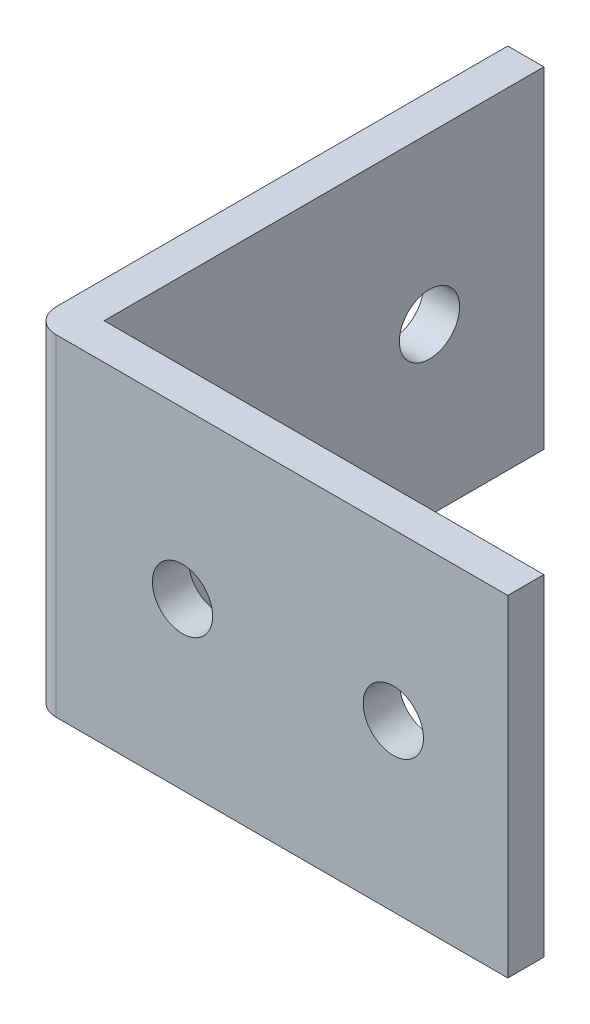
ISO-10303-21;
HEADER;
FILE_DESCRIPTION(('STEP AP214'),'2;1');
FILE_NAME('part.step','',(''),(''),'','','');
FILE_SCHEMA(('AUTOMOTIVE_DESIGN { 1 0 10303 214 1 1 1 1 }'));
ENDSEC;
DATA;
#1=APPLICATION_CONTEXT('core data for automotive mechanical design processes');
#2=APPLICATION_PROTOCOL_DEFINITION('international standard','automotive_design',2000,#1);
#3=PRODUCT_CONTEXT('',#1,'mechanical');
#4=PRODUCT('Part','Part','',(#3));
#5=PRODUCT_RELATED_PRODUCT_CATEGORY('part','',(#4));
#6=PRODUCT_DEFINITION_FORMATION('','',#4);
#7=PRODUCT_DEFINITION_CONTEXT('part definition',#1,'design');
#8=PRODUCT_DEFINITION('design','',#6,#7);
#9=PRODUCT_DEFINITION_SHAPE('','',#8);
#10=(LENGTH_UNIT() NAMED_UNIT(*) SI_UNIT(.MILLI.,.METRE.));
#11=(NAMED_UNIT(*) PLANE_ANGLE_UNIT() SI_UNIT($,.RADIAN.));
#12=(NAMED_UNIT(*) SI_UNIT($,.STERADIAN.) SOLID_ANGLE_UNIT());
#13=UNCERTAINTY_MEASURE_WITH_UNIT(LENGTH_MEASURE(1.E-05),#10,'distance_accuracy_value','');
#14=(GEOMETRIC_REPRESENTATION_CONTEXT(3) GLOBAL_UNCERTAINTY_ASSIGNED_CONTEXT((#13)) GLOBAL_UNIT_ASSIGNED_CONTEXT((#10,
#11,#12)) REPRESENTATION_CONTEXT('',''));
#15=CARTESIAN_POINT('',(0.,0.,0.));
#16=DIRECTION('',(0.,0.,1.));
#17=DIRECTION('',(1.,0.,0.));
#18=AXIS2_PLACEMENT_3D('',#15,#16,#17);
#19=CARTESIAN_POINT('',(0.,0.,0.));
#20=DIRECTION('',(0.,0.,1.));
#21=DIRECTION('',(1.,0.,0.));
#22=AXIS2_PLACEMENT_3D('',#19,#20,#21);
#23=PLANE('',#22);
#24=CARTESIAN_POINT('',(-7.13280898876404,-12.897191011236,0.));
#25=DIRECTION('',(0.,0.,1.));
#26=DIRECTION('',(1.,0.,0.));
#27=AXIS2_PLACEMENT_3D('',#24,#25,#26);
#28=CIRCLE('',#27,2.5);
#29=CARTESIAN_POINT('',(-4.63280898876404,-12.897191011236,0.));
#30=VERTEX_POINT('',#29);
#31=EDGE_CURVE('E127',#30,#30,#28,.T.);
#32=ORIENTED_EDGE('',*,*,#31,.T.);
#33=EDGE_LOOP('',(#32));
#34=FACE_BOUND('',#33,.T.);
#35=CARTESIAN_POINT('',(-24.632808988764,-12.897191011236,0.));
#36=DIRECTION('',(0.,0.,1.));
#37=DIRECTION('',(1.,0.,0.));
#38=AXIS2_PLACEMENT_3D('',#35,#36,#37);
#39=CIRCLE('',#38,2.5);
#40=CARTESIAN_POINT('',(-22.132808988764,-12.897191011236,0.));
#41=VERTEX_POINT('',#40);
#42=EDGE_CURVE('E131',#41,#41,#39,.T.);
#43=ORIENTED_EDGE('',*,*,#42,.T.);
#44=EDGE_LOOP('',(#43));
#45=FACE_BOUND('',#44,.T.);
#46=DIRECTION('',(0.,-1.,0.));
#47=VECTOR('',#46,1.);
#48=CARTESIAN_POINT('',(-34.132808988764,0.852808988764045,0.));
#49=LINE('',#48,#47);
#50=CARTESIAN_POINT('',(-34.132808988764,0.852808988764045,0.));
#51=VERTEX_POINT('',#50);
#52=CARTESIAN_POINT('',(-34.132808988764,-26.647191011236,0.));
#53=VERTEX_POINT('',#52);
#54=EDGE_CURVE('E113',#51,#53,#49,.T.);
#55=ORIENTED_EDGE('',*,*,#54,.F.);
#56=DIRECTION('',(-1.,0.,0.));
#57=VECTOR('',#56,1.);
#58=CARTESIAN_POINT('',(-37.132808988764,0.852808988764045,0.));
#59=LINE('',#58,#57);
#60=CARTESIAN_POINT('',(2.36719101123596,0.852808988764045,0.));
#61=VERTEX_POINT('',#60);
#62=EDGE_CURVE('E143',#61,#51,#59,.T.);
#63=ORIENTED_EDGE('',*,*,#62,.F.);
#64=DIRECTION('',(0.,1.,0.));
#65=VECTOR('',#64,1.);
#66=CARTESIAN_POINT('',(2.36719101123596,0.852808988764045,0.));
#67=LINE('',#66,#65);
#68=CARTESIAN_POINT('',(2.36719101123596,-26.647191011236,0.));
#69=VERTEX_POINT('',#68);
#70=EDGE_CURVE('E148',#69,#61,#67,.T.);
#71=ORIENTED_EDGE('',*,*,#70,.F.);
#72=DIRECTION('',(1.,0.,0.));
#73=VECTOR('',#72,1.);
#74=CARTESIAN_POINT('',(-37.132808988764,-26.647191011236,0.));
#75=LINE('',#74,#73);
#76=EDGE_CURVE('E137',#53,#69,#75,.T.);
#77=ORIENTED_EDGE('',*,*,#76,.F.);
#78=EDGE_LOOP('',(#55,#63,#71,#77));
#79=FACE_BOUND('',#78,.T.);
#80=ADVANCED_FACE('F34',(#34,#45,#79),#23,.F.);
#81=CARTESIAN_POINT('',(0.,0.,3.));
#82=DIRECTION('',(0.,0.,1.));
#83=DIRECTION('',(1.,0.,0.));
#84=AXIS2_PLACEMENT_3D('',#81,#82,#83);
#85=PLANE('',#84);
#86=CARTESIAN_POINT('',(-24.632808988764,-12.897191011236,3.));
#87=DIRECTION('',(0.,0.,1.));
#88=DIRECTION('',(1.,0.,0.));
#89=AXIS2_PLACEMENT_3D('',#86,#87,#88);
#90=CIRCLE('',#89,2.5);
#91=CARTESIAN_POINT('',(-22.132808988764,-12.897191011236,3.));
#92=VERTEX_POINT('',#91);
#93=EDGE_CURVE('E134',#92,#92,#90,.T.);
#94=ORIENTED_EDGE('',*,*,#93,.F.);
#95=EDGE_LOOP('',(#94));
#96=FACE_BOUND('',#95,.T.);
#97=DIRECTION('',(-1.,0.,0.));
#98=VECTOR('',#97,1.);
#99=CARTESIAN_POINT('',(-37.132808988764,0.852808988764045,3.));
#100=LINE('',#99,#98);
#101=CARTESIAN_POINT('',(2.36719101123596,0.852808988764045,3.));
#102=VERTEX_POINT('',#101);
#103=CARTESIAN_POINT('',(-35.132808988764,0.852808988764045,3.));
#104=VERTEX_POINT('',#103);
#105=EDGE_CURVE('E97',#102,#104,#100,.T.);
#106=ORIENTED_EDGE('',*,*,#105,.T.);
#107=DIRECTION('',(0.,-1.,0.));
#108=VECTOR('',#107,1.);
#109=CARTESIAN_POINT('',(-35.132808988764,-26.647191011236,3.));
#110=LINE('',#109,#108);
#111=CARTESIAN_POINT('',(-35.132808988764,-26.647191011236,3.));
#112=VERTEX_POINT('',#111);
#113=EDGE_CURVE('E158',#104,#112,#110,.T.);
#114=ORIENTED_EDGE('',*,*,#113,.T.);
#115=DIRECTION('',(1.,0.,0.));
#116=VECTOR('',#115,1.);
#117=CARTESIAN_POINT('',(-37.132808988764,-26.647191011236,3.));
#118=LINE('',#117,#116);
#119=CARTESIAN_POINT('',(2.36719101123596,-26.647191011236,3.));
#120=VERTEX_POINT('',#119);
#121=EDGE_CURVE('E140',#112,#120,#118,.T.);
#122=ORIENTED_EDGE('',*,*,#121,.T.);
#123=DIRECTION('',(0.,1.,0.));
#124=VECTOR('',#123,1.);
#125=CARTESIAN_POINT('',(2.36719101123596,0.852808988764045,3.));
#126=LINE('',#125,#124);
#127=EDGE_CURVE('E142',#120,#102,#126,.T.);
#128=ORIENTED_EDGE('',*,*,#127,.T.);
#129=EDGE_LOOP('',(#106,#114,#122,#128));
#130=FACE_BOUND('',#129,.T.);
#131=CARTESIAN_POINT('',(-7.13280898876404,-12.897191011236,3.));
#132=DIRECTION('',(0.,0.,1.));
#133=DIRECTION('',(1.,0.,0.));
#134=AXIS2_PLACEMENT_3D('',#131,#132,#133);
#135=CIRCLE('',#134,2.5);
#136=CARTESIAN_POINT('',(-4.63280898876404,-12.897191011236,3.));
#137=VERTEX_POINT('',#136);
#138=EDGE_CURVE('E128',#137,#137,#135,.T.);
#139=ORIENTED_EDGE('',*,*,#138,.F.);
#140=EDGE_LOOP('',(#139));
#141=FACE_BOUND('',#140,.T.);
#142=ADVANCED_FACE('F163',(#96,#130,#141),#85,.T.);
#143=CARTESIAN_POINT('',(-37.132808988764,0.852808988764045,3.));
#144=DIRECTION('',(1.,0.,0.));
#145=DIRECTION('',(0.,0.,-1.));
#146=AXIS2_PLACEMENT_3D('',#143,#144,#145);
#147=PLANE('',#146);
#148=CARTESIAN_POINT('',(-37.132808988764,-12.897191011236,-9.49999999999999));
#149=DIRECTION('',(1.,0.,0.));
#150=DIRECTION('',(0.,0.,-1.));
#151=AXIS2_PLACEMENT_3D('',#148,#149,#150);
#152=CIRCLE('',#151,2.5);
#153=CARTESIAN_POINT('',(-37.132808988764,-12.897191011236,-12.));
#154=VERTEX_POINT('',#153);
#155=EDGE_CURVE('E116',#154,#154,#152,.T.);
#156=ORIENTED_EDGE('',*,*,#155,.T.);
#157=EDGE_LOOP('',(#156));
#158=FACE_BOUND('',#157,.T.);
#159=CARTESIAN_POINT('',(-37.132808988764,-12.897191011236,-27.));
#160=DIRECTION('',(1.,0.,0.));
#161=DIRECTION('',(0.,0.,-1.));
#162=AXIS2_PLACEMENT_3D('',#159,#160,#161);
#163=CIRCLE('',#162,2.5);
#164=CARTESIAN_POINT('',(-37.132808988764,-12.897191011236,-29.5));
#165=VERTEX_POINT('',#164);
#166=EDGE_CURVE('E209',#165,#165,#163,.T.);
#167=ORIENTED_EDGE('',*,*,#166,.T.);
#168=EDGE_LOOP('',(#167));
#169=FACE_BOUND('',#168,.T.);
#170=DIRECTION('',(0.,0.,-1.));
#171=VECTOR('',#170,1.);
#172=CARTESIAN_POINT('',(-37.132808988764,-26.647191011236,3.));
#173=LINE('',#172,#171);
#174=CARTESIAN_POINT('',(-37.132808988764,-26.647191011236,1.));
#175=VERTEX_POINT('',#174);
#176=CARTESIAN_POINT('',(-37.132808988764,-26.647191011236,-36.5));
#177=VERTEX_POINT('',#176);
#178=EDGE_CURVE('E156',#175,#177,#173,.T.);
#179=ORIENTED_EDGE('',*,*,#178,.F.);
#180=DIRECTION('',(0.,-1.,0.));
#181=VECTOR('',#180,1.);
#182=CARTESIAN_POINT('',(-37.132808988764,0.852808988764045,1.));
#183=LINE('',#182,#181);
#184=CARTESIAN_POINT('',(-37.132808988764,0.852808988764045,1.));
#185=VERTEX_POINT('',#184);
#186=EDGE_CURVE('E42',#175,#185,#183,.F.);
#187=ORIENTED_EDGE('',*,*,#186,.T.);
#188=DIRECTION('',(0.,0.,-1.));
#189=VECTOR('',#188,1.);
#190=CARTESIAN_POINT('',(-37.132808988764,0.852808988764045,3.));
#191=LINE('',#190,#189);
#192=CARTESIAN_POINT('',(-37.132808988764,0.852808988764045,-36.5));
#193=VERTEX_POINT('',#192);
#194=EDGE_CURVE('E89',#185,#193,#191,.T.);
#195=ORIENTED_EDGE('',*,*,#194,.T.);
#196=DIRECTION('',(0.,1.,0.));
#197=VECTOR('',#196,1.);
#198=CARTESIAN_POINT('',(-37.132808988764,0.852808988764045,-36.5));
#199=LINE('',#198,#197);
#200=EDGE_CURVE('E93',#177,#193,#199,.T.);
#201=ORIENTED_EDGE('',*,*,#200,.F.);
#202=EDGE_LOOP('',(#179,#187,#195,#201));
#203=FACE_BOUND('',#202,.T.);
#204=ADVANCED_FACE('F91',(#158,#169,#203),#147,.F.);
#205=CARTESIAN_POINT('',(-37.132808988764,-26.647191011236,3.));
#206=DIRECTION('',(0.,1.,0.));
#207=DIRECTION('',(0.,0.,1.));
#208=AXIS2_PLACEMENT_3D('',#205,#206,#207);
#209=PLANE('',#208);
#210=ORIENTED_EDGE('',*,*,#121,.F.);
#211=CARTESIAN_POINT('',(-35.132808988764,-26.647191011236,1.));
#212=DIRECTION('',(0.,1.,0.));
#213=DIRECTION('',(0.,0.,1.));
#214=AXIS2_PLACEMENT_3D('',#211,#212,#213);
#215=CIRCLE('',#214,2.);
#216=EDGE_CURVE('E56',#112,#175,#215,.F.);
#217=ORIENTED_EDGE('',*,*,#216,.T.);
#218=ORIENTED_EDGE('',*,*,#178,.T.);
#219=DIRECTION('',(-1.,0.,0.));
#220=VECTOR('',#219,1.);
#221=CARTESIAN_POINT('',(-37.132808988764,-26.647191011236,-36.5));
#222=LINE('',#221,#220);
#223=CARTESIAN_POINT('',(-34.132808988764,-26.647191011236,-36.5));
#224=VERTEX_POINT('',#223);
#225=EDGE_CURVE('E112',#224,#177,#222,.T.);
#226=ORIENTED_EDGE('',*,*,#225,.F.);
#227=DIRECTION('',(0.,0.,1.));
#228=VECTOR('',#227,1.);
#229=CARTESIAN_POINT('',(-34.132808988764,-26.647191011236,-36.5));
#230=LINE('',#229,#228);
#231=EDGE_CURVE('E122',#224,#53,#230,.T.);
#232=ORIENTED_EDGE('',*,*,#231,.T.);
#233=ORIENTED_EDGE('',*,*,#76,.T.);
#234=DIRECTION('',(0.,0.,-1.));
#235=VECTOR('',#234,1.);
#236=CARTESIAN_POINT('',(2.36719101123596,-26.647191011236,3.));
#237=LINE('',#236,#235);
#238=EDGE_CURVE('E153',#120,#69,#237,.T.);
#239=ORIENTED_EDGE('',*,*,#238,.F.);
#240=EDGE_LOOP('',(#210,#217,#218,#226,#232,#233,#239));
#241=FACE_BOUND('',#240,.T.);
#242=ADVANCED_FACE('F168',(#241),#209,.F.);
#243=CARTESIAN_POINT('',(2.36719101123596,0.852808988764045,3.));
#244=DIRECTION('',(-1.,0.,0.));
#245=DIRECTION('',(0.,-1.,0.));
#246=AXIS2_PLACEMENT_3D('',#243,#244,#245);
#247=PLANE('',#246);
#248=ORIENTED_EDGE('',*,*,#70,.T.);
#249=DIRECTION('',(0.,0.,-1.));
#250=VECTOR('',#249,1.);
#251=CARTESIAN_POINT('',(2.36719101123596,0.852808988764045,3.));
#252=LINE('',#251,#250);
#253=EDGE_CURVE('E96',#102,#61,#252,.T.);
#254=ORIENTED_EDGE('',*,*,#253,.F.);
#255=ORIENTED_EDGE('',*,*,#127,.F.);
#256=ORIENTED_EDGE('',*,*,#238,.T.);
#257=EDGE_LOOP('',(#248,#254,#255,#256));
#258=FACE_BOUND('',#257,.T.);
#259=ADVANCED_FACE('F173',(#258),#247,.F.);
#260=CARTESIAN_POINT('',(-37.132808988764,0.852808988764045,3.));
#261=DIRECTION('',(0.,-1.,0.));
#262=DIRECTION('',(0.,0.,-1.));
#263=AXIS2_PLACEMENT_3D('',#260,#261,#262);
#264=PLANE('',#263);
#265=ORIENTED_EDGE('',*,*,#194,.F.);
#266=CARTESIAN_POINT('',(-35.132808988764,0.852808988764045,1.));
#267=DIRECTION('',(0.,-1.,0.));
#268=DIRECTION('',(0.,0.,-1.));
#269=AXIS2_PLACEMENT_3D('',#266,#267,#268);
#270=CIRCLE('',#269,2.);
#271=EDGE_CURVE('E11',#185,#104,#270,.F.);
#272=ORIENTED_EDGE('',*,*,#271,.T.);
#273=ORIENTED_EDGE('',*,*,#105,.F.);
#274=ORIENTED_EDGE('',*,*,#253,.T.);
#275=ORIENTED_EDGE('',*,*,#62,.T.);
#276=DIRECTION('',(0.,0.,1.));
#277=VECTOR('',#276,1.);
#278=CARTESIAN_POINT('',(-34.132808988764,0.852808988764045,-36.5));
#279=LINE('',#278,#277);
#280=CARTESIAN_POINT('',(-34.132808988764,0.852808988764045,-36.5));
#281=VERTEX_POINT('',#280);
#282=EDGE_CURVE('E104',#281,#51,#279,.T.);
#283=ORIENTED_EDGE('',*,*,#282,.F.);
#284=DIRECTION('',(1.,0.,0.));
#285=VECTOR('',#284,1.);
#286=CARTESIAN_POINT('',(-37.132808988764,0.852808988764045,-36.5));
#287=LINE('',#286,#285);
#288=EDGE_CURVE('E100',#193,#281,#287,.T.);
#289=ORIENTED_EDGE('',*,*,#288,.F.);
#290=EDGE_LOOP('',(#265,#272,#273,#274,#275,#283,#289));
#291=FACE_BOUND('',#290,.T.);
#292=ADVANCED_FACE('F101',(#291),#264,.F.);
#293=CARTESIAN_POINT('',(-24.632808988764,-12.897191011236,3.));
#294=DIRECTION('',(0.,0.,-1.));
#295=DIRECTION('',(-1.,0.,0.));
#296=AXIS2_PLACEMENT_3D('',#293,#294,#295);
#297=CYLINDRICAL_SURFACE('',#296,2.5);
#298=ORIENTED_EDGE('',*,*,#93,.T.);
#299=EDGE_LOOP('',(#298));
#300=FACE_BOUND('',#299,.T.);
#301=ORIENTED_EDGE('',*,*,#42,.F.);
#302=EDGE_LOOP('',(#301));
#303=FACE_BOUND('',#302,.T.);
#304=ADVANCED_FACE('F196',(#300,#303),#297,.F.);
#305=CARTESIAN_POINT('',(-7.13280898876404,-12.897191011236,3.));
#306=DIRECTION('',(0.,0.,-1.));
#307=DIRECTION('',(-1.,0.,0.));
#308=AXIS2_PLACEMENT_3D('',#305,#306,#307);
#309=CYLINDRICAL_SURFACE('',#308,2.5);
#310=ORIENTED_EDGE('',*,*,#138,.T.);
#311=EDGE_LOOP('',(#310));
#312=FACE_BOUND('',#311,.T.);
#313=ORIENTED_EDGE('',*,*,#31,.F.);
#314=EDGE_LOOP('',(#313));
#315=FACE_BOUND('',#314,.T.);
#316=ADVANCED_FACE('F223',(#312,#315),#309,.F.);
#317=CARTESIAN_POINT('',(-34.132808988764,0.852808988764045,-36.5));
#318=DIRECTION('',(-1.,0.,0.));
#319=DIRECTION('',(0.,0.,1.));
#320=AXIS2_PLACEMENT_3D('',#317,#318,#319);
#321=PLANE('',#320);
#322=CARTESIAN_POINT('',(-34.132808988764,-12.897191011236,-9.49999999999999));
#323=DIRECTION('',(1.,0.,0.));
#324=DIRECTION('',(0.,0.,-1.));
#325=AXIS2_PLACEMENT_3D('',#322,#323,#324);
#326=CIRCLE('',#325,2.5);
#327=CARTESIAN_POINT('',(-34.132808988764,-12.897191011236,-12.));
#328=VERTEX_POINT('',#327);
#329=EDGE_CURVE('E211',#328,#328,#326,.T.);
#330=ORIENTED_EDGE('',*,*,#329,.F.);
#331=EDGE_LOOP('',(#330));
#332=FACE_BOUND('',#331,.T.);
#333=CARTESIAN_POINT('',(-34.132808988764,-12.897191011236,-27.));
#334=DIRECTION('',(1.,0.,0.));
#335=DIRECTION('',(0.,0.,-1.));
#336=AXIS2_PLACEMENT_3D('',#333,#334,#335);
#337=CIRCLE('',#336,2.5);
#338=CARTESIAN_POINT('',(-34.132808988764,-12.897191011236,-29.5));
#339=VERTEX_POINT('',#338);
#340=EDGE_CURVE('E213',#339,#339,#337,.T.);
#341=ORIENTED_EDGE('',*,*,#340,.F.);
#342=EDGE_LOOP('',(#341));
#343=FACE_BOUND('',#342,.T.);
#344=ORIENTED_EDGE('',*,*,#54,.T.);
#345=ORIENTED_EDGE('',*,*,#231,.F.);
#346=DIRECTION('',(0.,-1.,0.));
#347=VECTOR('',#346,1.);
#348=CARTESIAN_POINT('',(-34.132808988764,0.852808988764045,-36.5));
#349=LINE('',#348,#347);
#350=EDGE_CURVE('E107',#281,#224,#349,.T.);
#351=ORIENTED_EDGE('',*,*,#350,.F.);
#352=ORIENTED_EDGE('',*,*,#282,.T.);
#353=EDGE_LOOP('',(#344,#345,#351,#352));
#354=FACE_BOUND('',#353,.T.);
#355=ADVANCED_FACE('F220',(#332,#343,#354),#321,.F.);
#356=CARTESIAN_POINT('',(0.,0.,-36.5));
#357=DIRECTION('',(0.,0.,1.));
#358=DIRECTION('',(1.,0.,0.));
#359=AXIS2_PLACEMENT_3D('',#356,#357,#358);
#360=PLANE('',#359);
#361=ORIENTED_EDGE('',*,*,#200,.T.);
#362=ORIENTED_EDGE('',*,*,#288,.T.);
#363=ORIENTED_EDGE('',*,*,#350,.T.);
#364=ORIENTED_EDGE('',*,*,#225,.T.);
#365=EDGE_LOOP('',(#361,#362,#363,#364));
#366=FACE_BOUND('',#365,.T.);
#367=ADVANCED_FACE('F110',(#366),#360,.F.);
#368=CARTESIAN_POINT('',(-70.632808988764,-12.897191011236,-27.));
#369=DIRECTION('',(1.,0.,0.));
#370=DIRECTION('',(0.,0.,-1.));
#371=AXIS2_PLACEMENT_3D('',#368,#369,#370);
#372=CYLINDRICAL_SURFACE('',#371,2.5);
#373=ORIENTED_EDGE('',*,*,#340,.T.);
#374=EDGE_LOOP('',(#373));
#375=FACE_BOUND('',#374,.T.);
#376=ORIENTED_EDGE('',*,*,#166,.F.);
#377=EDGE_LOOP('',(#376));
#378=FACE_BOUND('',#377,.T.);
#379=ADVANCED_FACE('F180',(#375,#378),#372,.F.);
#380=CARTESIAN_POINT('',(-70.632808988764,-12.897191011236,-9.49999999999999));
#381=DIRECTION('',(1.,0.,0.));
#382=DIRECTION('',(0.,0.,-1.));
#383=AXIS2_PLACEMENT_3D('',#380,#381,#382);
#384=CYLINDRICAL_SURFACE('',#383,2.5);
#385=ORIENTED_EDGE('',*,*,#329,.T.);
#386=EDGE_LOOP('',(#385));
#387=FACE_BOUND('',#386,.T.);
#388=ORIENTED_EDGE('',*,*,#155,.F.);
#389=EDGE_LOOP('',(#388));
#390=FACE_BOUND('',#389,.T.);
#391=ADVANCED_FACE('F176',(#387,#390),#384,.F.);
#392=CARTESIAN_POINT('',(-35.132808988764,0.,1.));
#393=DIRECTION('',(0.,1.,0.));
#394=DIRECTION('',(0.,0.,1.));
#395=AXIS2_PLACEMENT_3D('',#392,#393,#394);
#396=CYLINDRICAL_SURFACE('',#395,2.);
#397=ORIENTED_EDGE('',*,*,#271,.F.);
#398=ORIENTED_EDGE('',*,*,#186,.F.);
#399=ORIENTED_EDGE('',*,*,#216,.F.);
#400=ORIENTED_EDGE('',*,*,#113,.F.);
#401=EDGE_LOOP('',(#397,#398,#399,#400));
#402=FACE_BOUND('',#401,.T.);
#403=ADVANCED_FACE('F36',(#402),#396,.T.);
#404=CLOSED_SHELL('',(#80,#142,#204,#242,#259,#292,#304,#316,#355,#367,#379,#391,#403));
#405=MANIFOLD_SOLID_BREP('B2',#404);
#406=ADVANCED_BREP_SHAPE_REPRESENTATION('',(#18,#405),#14);
#407=SHAPE_DEFINITION_REPRESENTATION(#9,#406);
ENDSEC;
END-ISO-10303-21;
